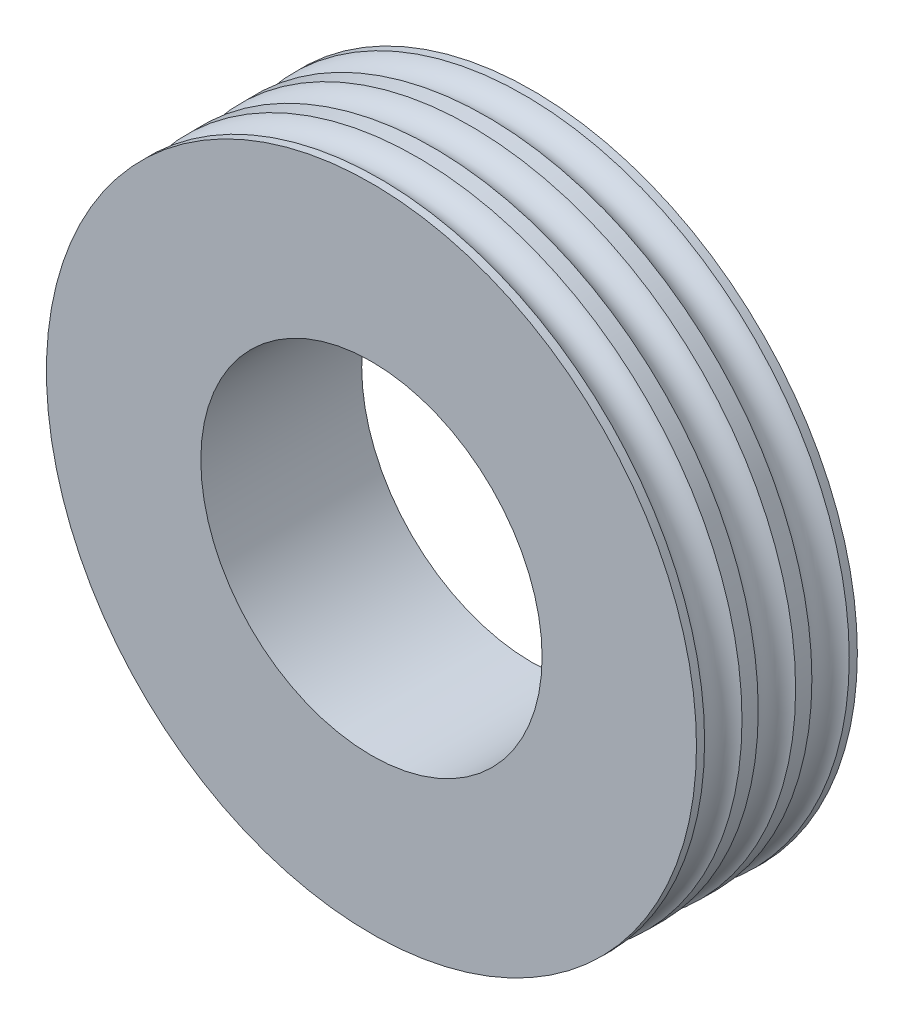
ISO-10303-21;
HEADER;
FILE_DESCRIPTION(('STEP AP214'),'2;1');
FILE_NAME('part.step','',(''),(''),'','','');
FILE_SCHEMA(('AUTOMOTIVE_DESIGN { 1 0 10303 214 1 1 1 1 }'));
ENDSEC;
DATA;
#1=APPLICATION_CONTEXT('core data for automotive mechanical design processes');
#2=APPLICATION_PROTOCOL_DEFINITION('international standard','automotive_design',2000,#1);
#3=PRODUCT_CONTEXT('',#1,'mechanical');
#4=PRODUCT('Part','Part','',(#3));
#5=PRODUCT_RELATED_PRODUCT_CATEGORY('part','',(#4));
#6=PRODUCT_DEFINITION_FORMATION('','',#4);
#7=PRODUCT_DEFINITION_CONTEXT('part definition',#1,'design');
#8=PRODUCT_DEFINITION('design','',#6,#7);
#9=PRODUCT_DEFINITION_SHAPE('','',#8);
#10=(LENGTH_UNIT() NAMED_UNIT(*) SI_UNIT(.MILLI.,.METRE.));
#11=(NAMED_UNIT(*) PLANE_ANGLE_UNIT() SI_UNIT($,.RADIAN.));
#12=(NAMED_UNIT(*) SI_UNIT($,.STERADIAN.) SOLID_ANGLE_UNIT());
#13=UNCERTAINTY_MEASURE_WITH_UNIT(LENGTH_MEASURE(1.E-05),#10,'distance_accuracy_value','');
#14=(GEOMETRIC_REPRESENTATION_CONTEXT(3) GLOBAL_UNCERTAINTY_ASSIGNED_CONTEXT((#13)) GLOBAL_UNIT_ASSIGNED_CONTEXT((#10,
#11,#12)) REPRESENTATION_CONTEXT('',''));
#15=CARTESIAN_POINT('',(0.,0.,0.));
#16=DIRECTION('',(0.,0.,1.));
#17=DIRECTION('',(1.,0.,0.));
#18=AXIS2_PLACEMENT_3D('',#15,#16,#17);
#19=CARTESIAN_POINT('',(0.,0.,3.0146773668033));
#20=DIRECTION('',(0.,0.,1.));
#21=DIRECTION('',(1.,0.,0.));
#22=AXIS2_PLACEMENT_3D('',#19,#20,#21);
#23=CYLINDRICAL_SURFACE('',#22,4.);
#24=CARTESIAN_POINT('',(0.,0.,0.44));
#25=DIRECTION('',(0.,0.,1.));
#26=DIRECTION('',(1.,0.,0.));
#27=AXIS2_PLACEMENT_3D('',#24,#25,#26);
#28=CIRCLE('',#27,4.);
#29=CARTESIAN_POINT('',(4.,0.,0.44));
#30=VERTEX_POINT('',#29);
#31=EDGE_CURVE('E10',#30,#30,#28,.T.);
#32=ORIENTED_EDGE('',*,*,#31,.F.);
#33=EDGE_LOOP('',(#32));
#34=FACE_BOUND('',#33,.T.);
#35=CARTESIAN_POINT('',(0.,0.,0.24));
#36=DIRECTION('',(0.,0.,1.));
#37=DIRECTION('',(1.,0.,0.));
#38=AXIS2_PLACEMENT_3D('',#35,#36,#37);
#39=CIRCLE('',#38,4.);
#40=CARTESIAN_POINT('',(4.,0.,0.24));
#41=VERTEX_POINT('',#40);
#42=EDGE_CURVE('E44',#41,#41,#39,.T.);
#43=ORIENTED_EDGE('',*,*,#42,.T.);
#44=EDGE_LOOP('',(#43));
#45=FACE_BOUND('',#44,.T.);
#46=ADVANCED_FACE('F34',(#34,#45),#23,.T.);
#47=CARTESIAN_POINT('',(0.,0.,0.67));
#48=DIRECTION('',(0.,0.,1.));
#49=DIRECTION('',(1.,0.,0.));
#50=AXIS2_PLACEMENT_3D('',#47,#48,#49);
#51=TOROIDAL_SURFACE('',#50,4.1,0.250798724079689);
#52=CARTESIAN_POINT('',(0.,0.,0.9));
#53=DIRECTION('',(0.,0.,1.));
#54=DIRECTION('',(1.,0.,0.));
#55=AXIS2_PLACEMENT_3D('',#52,#53,#54);
#56=CIRCLE('',#55,4.);
#57=CARTESIAN_POINT('',(4.,0.,0.9));
#58=VERTEX_POINT('',#57);
#59=EDGE_CURVE('E40',#58,#58,#56,.T.);
#60=ORIENTED_EDGE('',*,*,#59,.F.);
#61=EDGE_LOOP('',(#60));
#62=FACE_BOUND('',#61,.T.);
#63=ORIENTED_EDGE('',*,*,#31,.T.);
#64=EDGE_LOOP('',(#63));
#65=FACE_BOUND('',#64,.T.);
#66=ADVANCED_FACE('F91',(#62,#65),#51,.F.);
#67=CARTESIAN_POINT('',(0.,0.,3.0146773668033));
#68=DIRECTION('',(0.,0.,1.));
#69=DIRECTION('',(1.,0.,0.));
#70=AXIS2_PLACEMENT_3D('',#67,#68,#69);
#71=CYLINDRICAL_SURFACE('',#70,4.);
#72=ORIENTED_EDGE('',*,*,#59,.T.);
#73=EDGE_LOOP('',(#72));
#74=FACE_BOUND('',#73,.T.);
#75=CARTESIAN_POINT('',(0.,0.,1.1));
#76=DIRECTION('',(0.,0.,1.));
#77=DIRECTION('',(1.,0.,0.));
#78=AXIS2_PLACEMENT_3D('',#75,#76,#77);
#79=CIRCLE('',#78,4.);
#80=CARTESIAN_POINT('',(4.,0.,1.1));
#81=VERTEX_POINT('',#80);
#82=EDGE_CURVE('E62',#81,#81,#79,.T.);
#83=ORIENTED_EDGE('',*,*,#82,.F.);
#84=EDGE_LOOP('',(#83));
#85=FACE_BOUND('',#84,.T.);
#86=ADVANCED_FACE('F96',(#74,#85),#71,.T.);
#87=CARTESIAN_POINT('',(0.,0.,3.0146773668033));
#88=DIRECTION('',(0.,0.,1.));
#89=DIRECTION('',(1.,0.,0.));
#90=AXIS2_PLACEMENT_3D('',#87,#88,#89);
#91=CYLINDRICAL_SURFACE('',#90,2.1);
#92=CARTESIAN_POINT('',(0.,0.,-0.32));
#93=DIRECTION('',(0.,0.,1.));
#94=DIRECTION('',(1.,0.,0.));
#95=AXIS2_PLACEMENT_3D('',#92,#93,#94);
#96=CIRCLE('',#95,2.1);
#97=CARTESIAN_POINT('',(2.1,0.,-0.32));
#98=VERTEX_POINT('',#97);
#99=EDGE_CURVE('E56',#98,#98,#96,.T.);
#100=ORIENTED_EDGE('',*,*,#99,.F.);
#101=EDGE_LOOP('',(#100));
#102=FACE_BOUND('',#101,.T.);
#103=CARTESIAN_POINT('',(0.,0.,1.66));
#104=DIRECTION('',(0.,0.,1.));
#105=DIRECTION('',(1.,0.,0.));
#106=AXIS2_PLACEMENT_3D('',#103,#104,#105);
#107=CIRCLE('',#106,2.1);
#108=CARTESIAN_POINT('',(2.1,0.,1.66));
#109=VERTEX_POINT('',#108);
#110=EDGE_CURVE('E65',#109,#109,#107,.T.);
#111=ORIENTED_EDGE('',*,*,#110,.T.);
#112=EDGE_LOOP('',(#111));
#113=FACE_BOUND('',#112,.T.);
#114=ADVANCED_FACE('F103',(#102,#113),#91,.F.);
#115=CARTESIAN_POINT('',(0.,0.,0.00999999999999981));
#116=DIRECTION('',(0.,0.,-1.));
#117=DIRECTION('',(1.,0.,0.));
#118=AXIS2_PLACEMENT_3D('',#115,#116,#117);
#119=TOROIDAL_SURFACE('',#118,4.1,0.250798724079689);
#120=CARTESIAN_POINT('',(0.,0.,-0.22));
#121=DIRECTION('',(0.,0.,1.));
#122=DIRECTION('',(1.,0.,0.));
#123=AXIS2_PLACEMENT_3D('',#120,#121,#122);
#124=CIRCLE('',#123,4.);
#125=CARTESIAN_POINT('',(4.,0.,-0.22));
#126=VERTEX_POINT('',#125);
#127=EDGE_CURVE('E48',#126,#126,#124,.T.);
#128=ORIENTED_EDGE('',*,*,#127,.T.);
#129=EDGE_LOOP('',(#128));
#130=FACE_BOUND('',#129,.T.);
#131=ORIENTED_EDGE('',*,*,#42,.F.);
#132=EDGE_LOOP('',(#131));
#133=FACE_BOUND('',#132,.T.);
#134=ADVANCED_FACE('F101',(#130,#133),#119,.F.);
#135=CARTESIAN_POINT('',(0.,0.,-2.3346773668033));
#136=DIRECTION('',(0.,0.,-1.));
#137=DIRECTION('',(1.,0.,0.));
#138=AXIS2_PLACEMENT_3D('',#135,#136,#137);
#139=CYLINDRICAL_SURFACE('',#138,4.);
#140=CARTESIAN_POINT('',(0.,0.,-0.32));
#141=DIRECTION('',(0.,0.,1.));
#142=DIRECTION('',(1.,0.,0.));
#143=AXIS2_PLACEMENT_3D('',#140,#141,#142);
#144=CIRCLE('',#143,4.);
#145=CARTESIAN_POINT('',(4.,0.,-0.32));
#146=VERTEX_POINT('',#145);
#147=EDGE_CURVE('E53',#146,#146,#144,.T.);
#148=ORIENTED_EDGE('',*,*,#147,.T.);
#149=EDGE_LOOP('',(#148));
#150=FACE_BOUND('',#149,.T.);
#151=ORIENTED_EDGE('',*,*,#127,.F.);
#152=EDGE_LOOP('',(#151));
#153=FACE_BOUND('',#152,.T.);
#154=ADVANCED_FACE('F87',(#150,#153),#139,.T.);
#155=CARTESIAN_POINT('',(0.,4.,-0.32));
#156=DIRECTION('',(0.,0.,1.));
#157=DIRECTION('',(-1.,0.,0.));
#158=AXIS2_PLACEMENT_3D('',#155,#156,#157);
#159=PLANE('',#158);
#160=ORIENTED_EDGE('',*,*,#99,.T.);
#161=EDGE_LOOP('',(#160));
#162=FACE_BOUND('',#161,.T.);
#163=ORIENTED_EDGE('',*,*,#147,.F.);
#164=EDGE_LOOP('',(#163));
#165=FACE_BOUND('',#164,.T.);
#166=ADVANCED_FACE('F78',(#162,#165),#159,.F.);
#167=CARTESIAN_POINT('',(0.,0.,-1.0146773668033));
#168=DIRECTION('',(0.,0.,-1.));
#169=DIRECTION('',(1.,0.,0.));
#170=AXIS2_PLACEMENT_3D('',#167,#168,#169);
#171=CYLINDRICAL_SURFACE('',#170,4.);
#172=CARTESIAN_POINT('',(0.,0.,1.56));
#173=DIRECTION('',(0.,0.,1.));
#174=DIRECTION('',(1.,0.,0.));
#175=AXIS2_PLACEMENT_3D('',#172,#173,#174);
#176=CIRCLE('',#175,4.);
#177=CARTESIAN_POINT('',(4.,0.,1.56));
#178=VERTEX_POINT('',#177);
#179=EDGE_CURVE('E59',#178,#178,#176,.T.);
#180=ORIENTED_EDGE('',*,*,#179,.T.);
#181=EDGE_LOOP('',(#180));
#182=FACE_BOUND('',#181,.T.);
#183=CARTESIAN_POINT('',(0.,0.,1.66));
#184=DIRECTION('',(0.,0.,1.));
#185=DIRECTION('',(1.,0.,0.));
#186=AXIS2_PLACEMENT_3D('',#183,#184,#185);
#187=CIRCLE('',#186,4.);
#188=CARTESIAN_POINT('',(4.,0.,1.66));
#189=VERTEX_POINT('',#188);
#190=EDGE_CURVE('E68',#189,#189,#187,.T.);
#191=ORIENTED_EDGE('',*,*,#190,.F.);
#192=EDGE_LOOP('',(#191));
#193=FACE_BOUND('',#192,.T.);
#194=ADVANCED_FACE('F75',(#182,#193),#171,.T.);
#195=CARTESIAN_POINT('',(0.,0.,1.33));
#196=DIRECTION('',(0.,0.,-1.));
#197=DIRECTION('',(1.,0.,0.));
#198=AXIS2_PLACEMENT_3D('',#195,#196,#197);
#199=TOROIDAL_SURFACE('',#198,4.1,0.250798724079689);
#200=ORIENTED_EDGE('',*,*,#82,.T.);
#201=EDGE_LOOP('',(#200));
#202=FACE_BOUND('',#201,.T.);
#203=ORIENTED_EDGE('',*,*,#179,.F.);
#204=EDGE_LOOP('',(#203));
#205=FACE_BOUND('',#204,.T.);
#206=ADVANCED_FACE('F77',(#202,#205),#199,.F.);
#207=CARTESIAN_POINT('',(0.,2.1,1.66));
#208=DIRECTION('',(0.,0.,-1.));
#209=DIRECTION('',(1.,0.,0.));
#210=AXIS2_PLACEMENT_3D('',#207,#208,#209);
#211=PLANE('',#210);
#212=ORIENTED_EDGE('',*,*,#190,.T.);
#213=EDGE_LOOP('',(#212));
#214=FACE_BOUND('',#213,.T.);
#215=ORIENTED_EDGE('',*,*,#110,.F.);
#216=EDGE_LOOP('',(#215));
#217=FACE_BOUND('',#216,.T.);
#218=ADVANCED_FACE('F72',(#214,#217),#211,.F.);
#219=CLOSED_SHELL('',(#46,#66,#86,#114,#134,#154,#166,#194,#206,#218));
#220=MANIFOLD_SOLID_BREP('B2',#219);
#221=ADVANCED_BREP_SHAPE_REPRESENTATION('',(#18,#220),#14);
#222=SHAPE_DEFINITION_REPRESENTATION(#9,#221);
ENDSEC;
END-ISO-10303-21;
